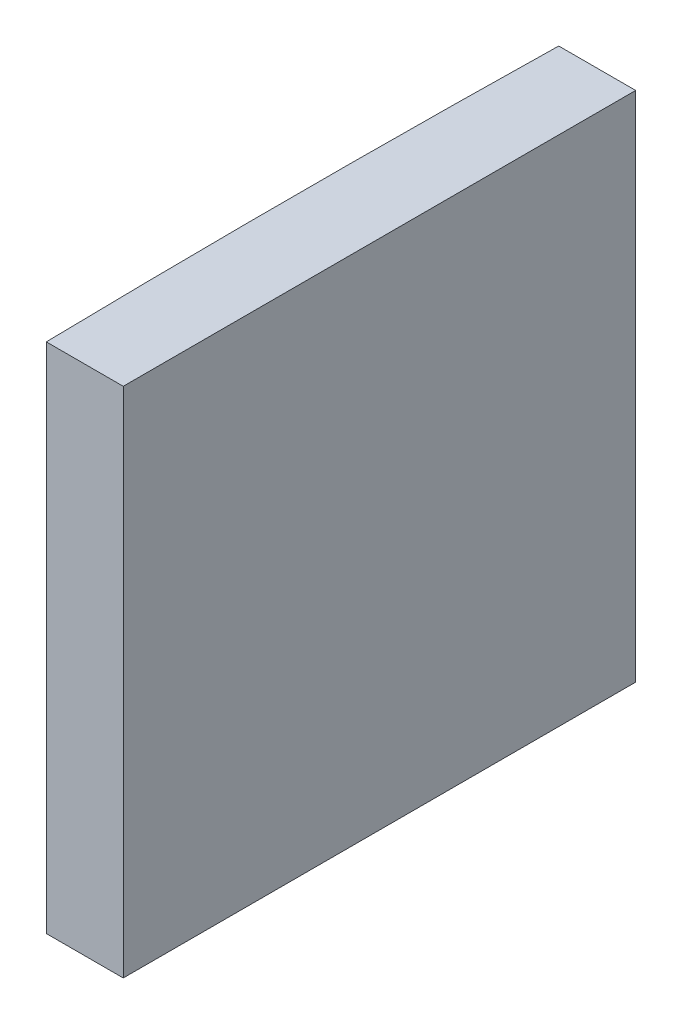
ISO-10303-21;
HEADER;
FILE_DESCRIPTION(('STEP AP214'),'2;1');
FILE_NAME('part.step','',(''),(''),'','','');
FILE_SCHEMA(('AUTOMOTIVE_DESIGN { 1 0 10303 214 1 1 1 1 }'));
ENDSEC;
DATA;
#1=APPLICATION_CONTEXT('core data for automotive mechanical design processes');
#2=APPLICATION_PROTOCOL_DEFINITION('international standard','automotive_design',2000,#1);
#3=PRODUCT_CONTEXT('',#1,'mechanical');
#4=PRODUCT('Part','Part','',(#3));
#5=PRODUCT_RELATED_PRODUCT_CATEGORY('part','',(#4));
#6=PRODUCT_DEFINITION_FORMATION('','',#4);
#7=PRODUCT_DEFINITION_CONTEXT('part definition',#1,'design');
#8=PRODUCT_DEFINITION('design','',#6,#7);
#9=PRODUCT_DEFINITION_SHAPE('','',#8);
#10=(LENGTH_UNIT() NAMED_UNIT(*) SI_UNIT(.MILLI.,.METRE.));
#11=(NAMED_UNIT(*) PLANE_ANGLE_UNIT() SI_UNIT($,.RADIAN.));
#12=(NAMED_UNIT(*) SI_UNIT($,.STERADIAN.) SOLID_ANGLE_UNIT());
#13=UNCERTAINTY_MEASURE_WITH_UNIT(LENGTH_MEASURE(1.E-05),#10,'distance_accuracy_value','');
#14=(GEOMETRIC_REPRESENTATION_CONTEXT(3) GLOBAL_UNCERTAINTY_ASSIGNED_CONTEXT((#13)) GLOBAL_UNIT_ASSIGNED_CONTEXT((#10,
#11,#12)) REPRESENTATION_CONTEXT('',''));
#15=CARTESIAN_POINT('',(0.,0.,0.));
#16=DIRECTION('',(0.,0.,1.));
#17=DIRECTION('',(1.,0.,0.));
#18=AXIS2_PLACEMENT_3D('',#15,#16,#17);
#19=CARTESIAN_POINT('',(4.35520433485127,20.,0.));
#20=DIRECTION('',(0.,-1.,0.));
#21=DIRECTION('',(0.,0.,-1.));
#22=AXIS2_PLACEMENT_3D('',#19,#20,#21);
#23=CYLINDRICAL_SURFACE('',#22,516.8);
#24=CARTESIAN_POINT('',(4.35520433485127,0.,0.));
#25=DIRECTION('',(0.,1.,0.));
#26=DIRECTION('',(0.,0.,1.));
#27=AXIS2_PLACEMENT_3D('',#24,#25,#26);
#28=CIRCLE('',#27,516.8);
#29=CARTESIAN_POINT('',(-512.34803738132,0.,-10.));
#30=VERTEX_POINT('',#29);
#31=CARTESIAN_POINT('',(-512.34803738132,0.,10.));
#32=VERTEX_POINT('',#31);
#33=EDGE_CURVE('E100',#30,#32,#28,.T.);
#34=ORIENTED_EDGE('',*,*,#33,.T.);
#35=DIRECTION('',(0.,-1.,0.));
#36=VECTOR('',#35,1.);
#37=CARTESIAN_POINT('',(-512.34803738132,20.,10.));
#38=LINE('',#37,#36);
#39=CARTESIAN_POINT('',(-512.34803738132,20.,10.));
#40=VERTEX_POINT('',#39);
#41=EDGE_CURVE('E11',#40,#32,#38,.T.);
#42=ORIENTED_EDGE('',*,*,#41,.F.);
#43=CARTESIAN_POINT('',(4.35520433485127,20.,0.));
#44=DIRECTION('',(0.,1.,0.));
#45=DIRECTION('',(0.,0.,1.));
#46=AXIS2_PLACEMENT_3D('',#43,#44,#45);
#47=CIRCLE('',#46,516.8);
#48=CARTESIAN_POINT('',(-512.34803738132,20.,-10.));
#49=VERTEX_POINT('',#48);
#50=EDGE_CURVE('E88',#49,#40,#47,.T.);
#51=ORIENTED_EDGE('',*,*,#50,.F.);
#52=DIRECTION('',(0.,-1.,0.));
#53=VECTOR('',#52,1.);
#54=CARTESIAN_POINT('',(-512.34803738132,20.,-10.));
#55=LINE('',#54,#53);
#56=EDGE_CURVE('E96',#49,#30,#55,.T.);
#57=ORIENTED_EDGE('',*,*,#56,.T.);
#58=EDGE_LOOP('',(#34,#42,#51,#57));
#59=FACE_BOUND('',#58,.T.);
#60=ADVANCED_FACE('F37',(#59),#23,.T.);
#61=CARTESIAN_POINT('',(-512.34803738132,20.,10.));
#62=DIRECTION('',(0.,0.,-1.));
#63=DIRECTION('',(-1.,0.,0.));
#64=AXIS2_PLACEMENT_3D('',#61,#62,#63);
#65=PLANE('',#64);
#66=DIRECTION('',(1.,0.,0.));
#67=VECTOR('',#66,1.);
#68=CARTESIAN_POINT('',(-512.34803738132,0.,10.));
#69=LINE('',#68,#67);
#70=CARTESIAN_POINT('',(-509.344795665149,0.,10.));
#71=VERTEX_POINT('',#70);
#72=EDGE_CURVE('E92',#32,#71,#69,.T.);
#73=ORIENTED_EDGE('',*,*,#72,.T.);
#74=DIRECTION('',(0.,-1.,0.));
#75=VECTOR('',#74,1.);
#76=CARTESIAN_POINT('',(-509.344795665149,20.,10.));
#77=LINE('',#76,#75);
#78=CARTESIAN_POINT('',(-509.344795665149,20.,10.));
#79=VERTEX_POINT('',#78);
#80=EDGE_CURVE('E45',#79,#71,#77,.T.);
#81=ORIENTED_EDGE('',*,*,#80,.F.);
#82=DIRECTION('',(1.,0.,0.));
#83=VECTOR('',#82,1.);
#84=CARTESIAN_POINT('',(-512.34803738132,20.,10.));
#85=LINE('',#84,#83);
#86=EDGE_CURVE('E83',#40,#79,#85,.T.);
#87=ORIENTED_EDGE('',*,*,#86,.F.);
#88=ORIENTED_EDGE('',*,*,#41,.T.);
#89=EDGE_LOOP('',(#73,#81,#87,#88));
#90=FACE_BOUND('',#89,.T.);
#91=ADVANCED_FACE('F91',(#90),#65,.F.);
#92=CARTESIAN_POINT('',(-509.344795665149,20.,-10.));
#93=DIRECTION('',(-1.,0.,0.));
#94=DIRECTION('',(0.,0.,1.));
#95=AXIS2_PLACEMENT_3D('',#92,#93,#94);
#96=PLANE('',#95);
#97=DIRECTION('',(0.,0.,-1.));
#98=VECTOR('',#97,1.);
#99=CARTESIAN_POINT('',(-509.344795665149,0.,-10.));
#100=LINE('',#99,#98);
#101=CARTESIAN_POINT('',(-509.344795665149,0.,-10.));
#102=VERTEX_POINT('',#101);
#103=EDGE_CURVE('E70',#71,#102,#100,.T.);
#104=ORIENTED_EDGE('',*,*,#103,.T.);
#105=DIRECTION('',(0.,-1.,0.));
#106=VECTOR('',#105,1.);
#107=CARTESIAN_POINT('',(-509.344795665149,20.,-10.));
#108=LINE('',#107,#106);
#109=CARTESIAN_POINT('',(-509.344795665149,20.,-10.));
#110=VERTEX_POINT('',#109);
#111=EDGE_CURVE('E93',#110,#102,#108,.T.);
#112=ORIENTED_EDGE('',*,*,#111,.F.);
#113=DIRECTION('',(0.,0.,-1.));
#114=VECTOR('',#113,1.);
#115=CARTESIAN_POINT('',(-509.344795665149,20.,-10.));
#116=LINE('',#115,#114);
#117=EDGE_CURVE('E86',#79,#110,#116,.T.);
#118=ORIENTED_EDGE('',*,*,#117,.F.);
#119=ORIENTED_EDGE('',*,*,#80,.T.);
#120=EDGE_LOOP('',(#104,#112,#118,#119));
#121=FACE_BOUND('',#120,.T.);
#122=ADVANCED_FACE('F94',(#121),#96,.F.);
#123=CARTESIAN_POINT('',(-512.34803738132,20.,-10.));
#124=DIRECTION('',(0.,0.,1.));
#125=DIRECTION('',(1.,0.,0.));
#126=AXIS2_PLACEMENT_3D('',#123,#124,#125);
#127=PLANE('',#126);
#128=DIRECTION('',(-1.,0.,0.));
#129=VECTOR('',#128,1.);
#130=CARTESIAN_POINT('',(-512.34803738132,0.,-10.));
#131=LINE('',#130,#129);
#132=EDGE_CURVE('E76',#102,#30,#131,.T.);
#133=ORIENTED_EDGE('',*,*,#132,.T.);
#134=ORIENTED_EDGE('',*,*,#56,.F.);
#135=DIRECTION('',(-1.,0.,0.));
#136=VECTOR('',#135,1.);
#137=CARTESIAN_POINT('',(-512.34803738132,20.,-10.));
#138=LINE('',#137,#136);
#139=EDGE_CURVE('E53',#110,#49,#138,.T.);
#140=ORIENTED_EDGE('',*,*,#139,.F.);
#141=ORIENTED_EDGE('',*,*,#111,.T.);
#142=EDGE_LOOP('',(#133,#134,#140,#141));
#143=FACE_BOUND('',#142,.T.);
#144=ADVANCED_FACE('F107',(#143),#127,.F.);
#145=CARTESIAN_POINT('',(4.35520433485127,20.,0.));
#146=DIRECTION('',(0.,1.,0.));
#147=DIRECTION('',(0.,0.,1.));
#148=AXIS2_PLACEMENT_3D('',#145,#146,#147);
#149=PLANE('',#148);
#150=ORIENTED_EDGE('',*,*,#50,.T.);
#151=ORIENTED_EDGE('',*,*,#86,.T.);
#152=ORIENTED_EDGE('',*,*,#117,.T.);
#153=ORIENTED_EDGE('',*,*,#139,.T.);
#154=EDGE_LOOP('',(#150,#151,#152,#153));
#155=FACE_BOUND('',#154,.T.);
#156=ADVANCED_FACE('F84',(#155),#149,.T.);
#157=CARTESIAN_POINT('',(4.35520433485127,0.,0.));
#158=DIRECTION('',(0.,1.,0.));
#159=DIRECTION('',(0.,0.,1.));
#160=AXIS2_PLACEMENT_3D('',#157,#158,#159);
#161=PLANE('',#160);
#162=ORIENTED_EDGE('',*,*,#33,.F.);
#163=ORIENTED_EDGE('',*,*,#132,.F.);
#164=ORIENTED_EDGE('',*,*,#103,.F.);
#165=ORIENTED_EDGE('',*,*,#72,.F.);
#166=EDGE_LOOP('',(#162,#163,#164,#165));
#167=FACE_BOUND('',#166,.T.);
#168=ADVANCED_FACE('F110',(#167),#161,.F.);
#169=CLOSED_SHELL('',(#60,#91,#122,#144,#156,#168));
#170=MANIFOLD_SOLID_BREP('B2',#169);
#171=ADVANCED_BREP_SHAPE_REPRESENTATION('',(#18,#170),#14);
#172=SHAPE_DEFINITION_REPRESENTATION(#9,#171);
ENDSEC;
END-ISO-10303-21;
